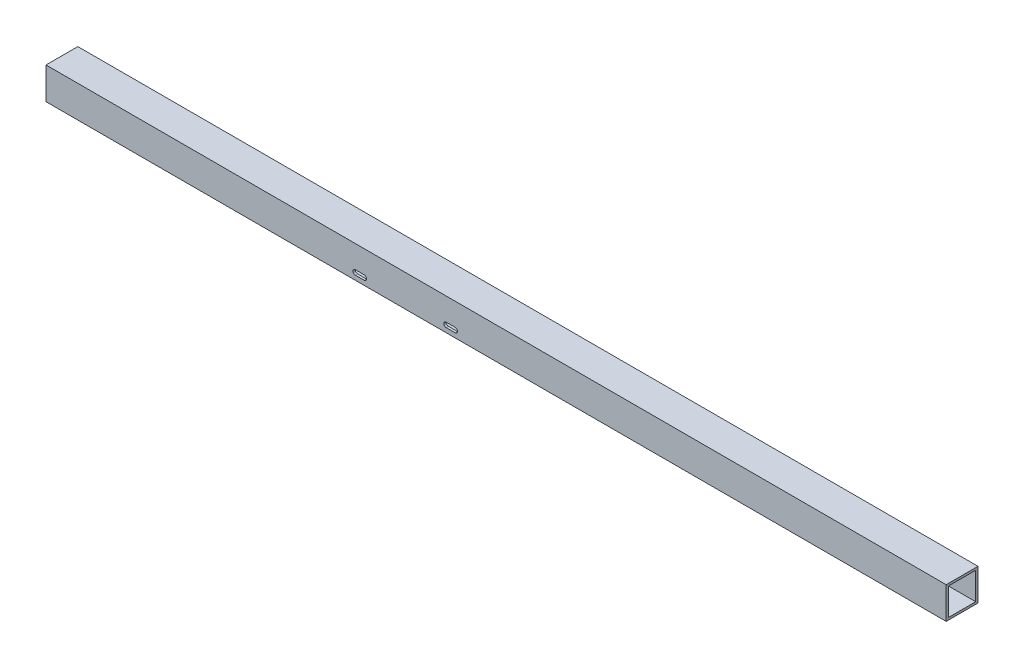
ISO-10303-21;
HEADER;
FILE_DESCRIPTION(('STEP AP214'),'2;1');
FILE_NAME('part.step','',(''),(''),'','','');
FILE_SCHEMA(('AUTOMOTIVE_DESIGN { 1 0 10303 214 1 1 1 1 }'));
ENDSEC;
DATA;
#1=APPLICATION_CONTEXT('core data for automotive mechanical design processes');
#2=APPLICATION_PROTOCOL_DEFINITION('international standard','automotive_design',2000,#1);
#3=PRODUCT_CONTEXT('',#1,'mechanical');
#4=PRODUCT('Part','Part','',(#3));
#5=PRODUCT_RELATED_PRODUCT_CATEGORY('part','',(#4));
#6=PRODUCT_DEFINITION_FORMATION('','',#4);
#7=PRODUCT_DEFINITION_CONTEXT('part definition',#1,'design');
#8=PRODUCT_DEFINITION('design','',#6,#7);
#9=PRODUCT_DEFINITION_SHAPE('','',#8);
#10=(LENGTH_UNIT() NAMED_UNIT(*) SI_UNIT(.MILLI.,.METRE.));
#11=(NAMED_UNIT(*) PLANE_ANGLE_UNIT() SI_UNIT($,.RADIAN.));
#12=(NAMED_UNIT(*) SI_UNIT($,.STERADIAN.) SOLID_ANGLE_UNIT());
#13=UNCERTAINTY_MEASURE_WITH_UNIT(LENGTH_MEASURE(1.E-05),#10,'distance_accuracy_value','');
#14=(GEOMETRIC_REPRESENTATION_CONTEXT(3) GLOBAL_UNCERTAINTY_ASSIGNED_CONTEXT((#13)) GLOBAL_UNIT_ASSIGNED_CONTEXT((#10,
#11,#12)) REPRESENTATION_CONTEXT('',''));
#15=CARTESIAN_POINT('',(0.,0.,0.));
#16=DIRECTION('',(0.,0.,1.));
#17=DIRECTION('',(1.,0.,0.));
#18=AXIS2_PLACEMENT_3D('',#15,#16,#17);
#19=CARTESIAN_POINT('',(628.65,0.,0.));
#20=DIRECTION('',(1.,0.,0.));
#21=DIRECTION('',(0.,0.,-1.));
#22=AXIS2_PLACEMENT_3D('',#19,#20,#21);
#23=PLANE('',#22);
#24=DIRECTION('',(0.,-1.,0.));
#25=VECTOR('',#24,1.);
#26=CARTESIAN_POINT('',(628.65,44.45,0.));
#27=LINE('',#26,#25);
#28=CARTESIAN_POINT('',(628.65,44.45,0.));
#29=VERTEX_POINT('',#28);
#30=CARTESIAN_POINT('',(628.65,0.,0.));
#31=VERTEX_POINT('',#30);
#32=EDGE_CURVE('E250',#29,#31,#27,.T.);
#33=ORIENTED_EDGE('',*,*,#32,.T.);
#34=DIRECTION('',(0.,0.,-1.));
#35=VECTOR('',#34,1.);
#36=CARTESIAN_POINT('',(628.65,0.,0.));
#37=LINE('',#36,#35);
#38=CARTESIAN_POINT('',(628.65,0.,-44.45));
#39=VERTEX_POINT('',#38);
#40=EDGE_CURVE('E253',#31,#39,#37,.T.);
#41=ORIENTED_EDGE('',*,*,#40,.T.);
#42=DIRECTION('',(0.,1.,0.));
#43=VECTOR('',#42,1.);
#44=CARTESIAN_POINT('',(628.65,0.,-44.45));
#45=LINE('',#44,#43);
#46=CARTESIAN_POINT('',(628.65,44.45,-44.45));
#47=VERTEX_POINT('',#46);
#48=EDGE_CURVE('E256',#39,#47,#45,.T.);
#49=ORIENTED_EDGE('',*,*,#48,.T.);
#50=DIRECTION('',(0.,0.,1.));
#51=VECTOR('',#50,1.);
#52=CARTESIAN_POINT('',(628.65,44.45,-44.45));
#53=LINE('',#52,#51);
#54=EDGE_CURVE('E258',#47,#29,#53,.T.);
#55=ORIENTED_EDGE('',*,*,#54,.T.);
#56=EDGE_LOOP('',(#33,#41,#49,#55));
#57=FACE_BOUND('',#56,.T.);
#58=DIRECTION('',(0.,0.,1.));
#59=VECTOR('',#58,1.);
#60=CARTESIAN_POINT('',(628.65,41.275,-41.275));
#61=LINE('',#60,#59);
#62=CARTESIAN_POINT('',(628.65,41.275,-41.275));
#63=VERTEX_POINT('',#62);
#64=CARTESIAN_POINT('',(628.65,41.275,-3.175));
#65=VERTEX_POINT('',#64);
#66=EDGE_CURVE('E221',#63,#65,#61,.T.);
#67=ORIENTED_EDGE('',*,*,#66,.F.);
#68=DIRECTION('',(0.,1.,0.));
#69=VECTOR('',#68,1.);
#70=CARTESIAN_POINT('',(628.65,3.175,-41.275));
#71=LINE('',#70,#69);
#72=CARTESIAN_POINT('',(628.65,3.175,-41.275));
#73=VERTEX_POINT('',#72);
#74=EDGE_CURVE('E219',#73,#63,#71,.T.);
#75=ORIENTED_EDGE('',*,*,#74,.F.);
#76=DIRECTION('',(0.,0.,-1.));
#77=VECTOR('',#76,1.);
#78=CARTESIAN_POINT('',(628.65,3.175,-3.17500000000001));
#79=LINE('',#78,#77);
#80=CARTESIAN_POINT('',(628.65,3.175,-3.17500000000001));
#81=VERTEX_POINT('',#80);
#82=EDGE_CURVE('E227',#81,#73,#79,.T.);
#83=ORIENTED_EDGE('',*,*,#82,.F.);
#84=DIRECTION('',(0.,-1.,0.));
#85=VECTOR('',#84,1.);
#86=CARTESIAN_POINT('',(628.65,41.275,-3.175));
#87=LINE('',#86,#85);
#88=EDGE_CURVE('E224',#65,#81,#87,.T.);
#89=ORIENTED_EDGE('',*,*,#88,.F.);
#90=EDGE_LOOP('',(#67,#75,#83,#89));
#91=FACE_BOUND('',#90,.T.);
#92=ADVANCED_FACE('F35',(#57,#91),#23,.T.);
#93=CARTESIAN_POINT('',(-628.65,0.,0.));
#94=DIRECTION('',(1.,0.,0.));
#95=DIRECTION('',(0.,0.,-1.));
#96=AXIS2_PLACEMENT_3D('',#93,#94,#95);
#97=PLANE('',#96);
#98=DIRECTION('',(0.,-1.,0.));
#99=VECTOR('',#98,1.);
#100=CARTESIAN_POINT('',(-628.65,44.45,0.));
#101=LINE('',#100,#99);
#102=CARTESIAN_POINT('',(-628.65,44.45,0.));
#103=VERTEX_POINT('',#102);
#104=CARTESIAN_POINT('',(-628.65,0.,0.));
#105=VERTEX_POINT('',#104);
#106=EDGE_CURVE('E249',#103,#105,#101,.T.);
#107=ORIENTED_EDGE('',*,*,#106,.F.);
#108=DIRECTION('',(0.,0.,1.));
#109=VECTOR('',#108,1.);
#110=CARTESIAN_POINT('',(-628.65,44.45,-44.45));
#111=LINE('',#110,#109);
#112=CARTESIAN_POINT('',(-628.65,44.45,-44.45));
#113=VERTEX_POINT('',#112);
#114=EDGE_CURVE('E254',#113,#103,#111,.T.);
#115=ORIENTED_EDGE('',*,*,#114,.F.);
#116=DIRECTION('',(0.,1.,0.));
#117=VECTOR('',#116,1.);
#118=CARTESIAN_POINT('',(-628.65,0.,-44.45));
#119=LINE('',#118,#117);
#120=CARTESIAN_POINT('',(-628.65,0.,-44.45));
#121=VERTEX_POINT('',#120);
#122=EDGE_CURVE('E265',#121,#113,#119,.T.);
#123=ORIENTED_EDGE('',*,*,#122,.F.);
#124=DIRECTION('',(0.,0.,-1.));
#125=VECTOR('',#124,1.);
#126=CARTESIAN_POINT('',(-628.65,0.,0.));
#127=LINE('',#126,#125);
#128=EDGE_CURVE('E263',#105,#121,#127,.T.);
#129=ORIENTED_EDGE('',*,*,#128,.F.);
#130=EDGE_LOOP('',(#107,#115,#123,#129));
#131=FACE_BOUND('',#130,.T.);
#132=DIRECTION('',(0.,1.,0.));
#133=VECTOR('',#132,1.);
#134=CARTESIAN_POINT('',(-628.65,3.175,-41.275));
#135=LINE('',#134,#133);
#136=CARTESIAN_POINT('',(-628.65,3.175,-41.275));
#137=VERTEX_POINT('',#136);
#138=CARTESIAN_POINT('',(-628.65,41.275,-41.275));
#139=VERTEX_POINT('',#138);
#140=EDGE_CURVE('E192',#137,#139,#135,.T.);
#141=ORIENTED_EDGE('',*,*,#140,.T.);
#142=DIRECTION('',(0.,0.,1.));
#143=VECTOR('',#142,1.);
#144=CARTESIAN_POINT('',(-628.65,41.275,-41.275));
#145=LINE('',#144,#143);
#146=CARTESIAN_POINT('',(-628.65,41.275,-3.175));
#147=VERTEX_POINT('',#146);
#148=EDGE_CURVE('E232',#139,#147,#145,.T.);
#149=ORIENTED_EDGE('',*,*,#148,.T.);
#150=DIRECTION('',(0.,-1.,0.));
#151=VECTOR('',#150,1.);
#152=CARTESIAN_POINT('',(-628.65,41.275,-3.175));
#153=LINE('',#152,#151);
#154=CARTESIAN_POINT('',(-628.65,3.175,-3.17500000000001));
#155=VERTEX_POINT('',#154);
#156=EDGE_CURVE('E235',#147,#155,#153,.T.);
#157=ORIENTED_EDGE('',*,*,#156,.T.);
#158=DIRECTION('',(0.,0.,-1.));
#159=VECTOR('',#158,1.);
#160=CARTESIAN_POINT('',(-628.65,3.175,-3.17500000000001));
#161=LINE('',#160,#159);
#162=EDGE_CURVE('E222',#155,#137,#161,.T.);
#163=ORIENTED_EDGE('',*,*,#162,.T.);
#164=EDGE_LOOP('',(#141,#149,#157,#163));
#165=FACE_BOUND('',#164,.T.);
#166=ADVANCED_FACE('F283',(#131,#165),#97,.F.);
#167=CARTESIAN_POINT('',(628.65,44.45,0.));
#168=DIRECTION('',(0.,0.,-1.));
#169=DIRECTION('',(0.,1.,0.));
#170=AXIS2_PLACEMENT_3D('',#167,#168,#169);
#171=PLANE('',#170);
#172=CARTESIAN_POINT('',(-184.277,9.525,0.));
#173=DIRECTION('',(0.,0.,1.));
#174=DIRECTION('',(1.,0.,0.));
#175=AXIS2_PLACEMENT_3D('',#172,#173,#174);
#176=CIRCLE('',#175,3.302);
#177=CARTESIAN_POINT('',(-184.277,6.223,0.));
#178=VERTEX_POINT('',#177);
#179=CARTESIAN_POINT('',(-184.277,12.827,0.));
#180=VERTEX_POINT('',#179);
#181=EDGE_CURVE('E164',#178,#180,#176,.T.);
#182=ORIENTED_EDGE('',*,*,#181,.F.);
#183=DIRECTION('',(1.,0.,0.));
#184=VECTOR('',#183,1.);
#185=CARTESIAN_POINT('',(-196.723,6.223,0.));
#186=LINE('',#185,#184);
#187=CARTESIAN_POINT('',(-196.723,6.223,0.));
#188=VERTEX_POINT('',#187);
#189=EDGE_CURVE('E182',#188,#178,#186,.T.);
#190=ORIENTED_EDGE('',*,*,#189,.F.);
#191=CARTESIAN_POINT('',(-196.723,9.525,0.));
#192=DIRECTION('',(0.,0.,1.));
#193=DIRECTION('',(1.,0.,0.));
#194=AXIS2_PLACEMENT_3D('',#191,#192,#193);
#195=CIRCLE('',#194,3.302);
#196=CARTESIAN_POINT('',(-196.723,12.827,0.));
#197=VERTEX_POINT('',#196);
#198=EDGE_CURVE('E179',#197,#188,#195,.T.);
#199=ORIENTED_EDGE('',*,*,#198,.F.);
#200=DIRECTION('',(-1.,0.,0.));
#201=VECTOR('',#200,1.);
#202=CARTESIAN_POINT('',(-196.723,12.827,0.));
#203=LINE('',#202,#201);
#204=EDGE_CURVE('E50',#180,#197,#203,.T.);
#205=ORIENTED_EDGE('',*,*,#204,.F.);
#206=EDGE_LOOP('',(#182,#190,#199,#205));
#207=FACE_BOUND('',#206,.T.);
#208=CARTESIAN_POINT('',(-57.277,9.525,0.));
#209=DIRECTION('',(0.,0.,1.));
#210=DIRECTION('',(1.,0.,0.));
#211=AXIS2_PLACEMENT_3D('',#208,#209,#210);
#212=CIRCLE('',#211,3.302);
#213=CARTESIAN_POINT('',(-57.277,6.223,0.));
#214=VERTEX_POINT('',#213);
#215=CARTESIAN_POINT('',(-57.277,12.827,0.));
#216=VERTEX_POINT('',#215);
#217=EDGE_CURVE('E208',#214,#216,#212,.T.);
#218=ORIENTED_EDGE('',*,*,#217,.F.);
#219=DIRECTION('',(1.,0.,0.));
#220=VECTOR('',#219,1.);
#221=CARTESIAN_POINT('',(-69.723,6.223,0.));
#222=LINE('',#221,#220);
#223=CARTESIAN_POINT('',(-69.723,6.223,0.));
#224=VERTEX_POINT('',#223);
#225=EDGE_CURVE('E205',#224,#214,#222,.T.);
#226=ORIENTED_EDGE('',*,*,#225,.F.);
#227=CARTESIAN_POINT('',(-69.723,9.525,0.));
#228=DIRECTION('',(0.,0.,1.));
#229=DIRECTION('',(1.,0.,0.));
#230=AXIS2_PLACEMENT_3D('',#227,#228,#229);
#231=CIRCLE('',#230,3.302);
#232=CARTESIAN_POINT('',(-69.723,12.827,0.));
#233=VERTEX_POINT('',#232);
#234=EDGE_CURVE('E202',#233,#224,#231,.T.);
#235=ORIENTED_EDGE('',*,*,#234,.F.);
#236=DIRECTION('',(-1.,0.,0.));
#237=VECTOR('',#236,1.);
#238=CARTESIAN_POINT('',(-69.723,12.827,0.));
#239=LINE('',#238,#237);
#240=EDGE_CURVE('E58',#216,#233,#239,.T.);
#241=ORIENTED_EDGE('',*,*,#240,.F.);
#242=EDGE_LOOP('',(#218,#226,#235,#241));
#243=FACE_BOUND('',#242,.T.);
#244=ORIENTED_EDGE('',*,*,#106,.T.);
#245=DIRECTION('',(-1.,0.,0.));
#246=VECTOR('',#245,1.);
#247=CARTESIAN_POINT('',(628.65,0.,0.));
#248=LINE('',#247,#246);
#249=EDGE_CURVE('E11',#31,#105,#248,.T.);
#250=ORIENTED_EDGE('',*,*,#249,.F.);
#251=ORIENTED_EDGE('',*,*,#32,.F.);
#252=DIRECTION('',(-1.,0.,0.));
#253=VECTOR('',#252,1.);
#254=CARTESIAN_POINT('',(628.65,44.45,0.));
#255=LINE('',#254,#253);
#256=EDGE_CURVE('E260',#29,#103,#255,.T.);
#257=ORIENTED_EDGE('',*,*,#256,.T.);
#258=EDGE_LOOP('',(#244,#250,#251,#257));
#259=FACE_BOUND('',#258,.T.);
#260=ADVANCED_FACE('F37',(#207,#243,#259),#171,.F.);
#261=CARTESIAN_POINT('',(628.65,0.,0.));
#262=DIRECTION('',(0.,1.,0.));
#263=DIRECTION('',(0.,0.,1.));
#264=AXIS2_PLACEMENT_3D('',#261,#262,#263);
#265=PLANE('',#264);
#266=ORIENTED_EDGE('',*,*,#128,.T.);
#267=DIRECTION('',(-1.,0.,0.));
#268=VECTOR('',#267,1.);
#269=CARTESIAN_POINT('',(628.65,0.,-44.45));
#270=LINE('',#269,#268);
#271=EDGE_CURVE('E43',#39,#121,#270,.T.);
#272=ORIENTED_EDGE('',*,*,#271,.F.);
#273=ORIENTED_EDGE('',*,*,#40,.F.);
#274=ORIENTED_EDGE('',*,*,#249,.T.);
#275=EDGE_LOOP('',(#266,#272,#273,#274));
#276=FACE_BOUND('',#275,.T.);
#277=ADVANCED_FACE('F294',(#276),#265,.F.);
#278=CARTESIAN_POINT('',(628.65,0.,-44.45));
#279=DIRECTION('',(0.,0.,1.));
#280=DIRECTION('',(0.,-1.,0.));
#281=AXIS2_PLACEMENT_3D('',#278,#279,#280);
#282=PLANE('',#281);
#283=ORIENTED_EDGE('',*,*,#122,.T.);
#284=DIRECTION('',(-1.,0.,0.));
#285=VECTOR('',#284,1.);
#286=CARTESIAN_POINT('',(628.65,44.45,-44.45));
#287=LINE('',#286,#285);
#288=EDGE_CURVE('E270',#47,#113,#287,.T.);
#289=ORIENTED_EDGE('',*,*,#288,.F.);
#290=ORIENTED_EDGE('',*,*,#48,.F.);
#291=ORIENTED_EDGE('',*,*,#271,.T.);
#292=EDGE_LOOP('',(#283,#289,#290,#291));
#293=FACE_BOUND('',#292,.T.);
#294=ADVANCED_FACE('F277',(#293),#282,.F.);
#295=CARTESIAN_POINT('',(628.65,44.45,-44.45));
#296=DIRECTION('',(0.,-1.,0.));
#297=DIRECTION('',(0.,0.,-1.));
#298=AXIS2_PLACEMENT_3D('',#295,#296,#297);
#299=PLANE('',#298);
#300=ORIENTED_EDGE('',*,*,#114,.T.);
#301=ORIENTED_EDGE('',*,*,#256,.F.);
#302=ORIENTED_EDGE('',*,*,#54,.F.);
#303=ORIENTED_EDGE('',*,*,#288,.T.);
#304=EDGE_LOOP('',(#300,#301,#302,#303));
#305=FACE_BOUND('',#304,.T.);
#306=ADVANCED_FACE('F287',(#305),#299,.F.);
#307=CARTESIAN_POINT('',(628.65,3.175,-41.275));
#308=DIRECTION('',(0.,0.,1.));
#309=DIRECTION('',(0.,-1.,0.));
#310=AXIS2_PLACEMENT_3D('',#307,#308,#309);
#311=PLANE('',#310);
#312=ORIENTED_EDGE('',*,*,#140,.F.);
#313=DIRECTION('',(-1.,0.,0.));
#314=VECTOR('',#313,1.);
#315=CARTESIAN_POINT('',(628.65,3.175,-41.275));
#316=LINE('',#315,#314);
#317=EDGE_CURVE('E229',#73,#137,#316,.T.);
#318=ORIENTED_EDGE('',*,*,#317,.F.);
#319=ORIENTED_EDGE('',*,*,#74,.T.);
#320=DIRECTION('',(-1.,0.,0.));
#321=VECTOR('',#320,1.);
#322=CARTESIAN_POINT('',(628.65,41.275,-41.275));
#323=LINE('',#322,#321);
#324=EDGE_CURVE('E246',#63,#139,#323,.T.);
#325=ORIENTED_EDGE('',*,*,#324,.T.);
#326=EDGE_LOOP('',(#312,#318,#319,#325));
#327=FACE_BOUND('',#326,.T.);
#328=ADVANCED_FACE('F310',(#327),#311,.T.);
#329=CARTESIAN_POINT('',(628.65,41.275,-41.275));
#330=DIRECTION('',(0.,-1.,0.));
#331=DIRECTION('',(0.,0.,-1.));
#332=AXIS2_PLACEMENT_3D('',#329,#330,#331);
#333=PLANE('',#332);
#334=ORIENTED_EDGE('',*,*,#148,.F.);
#335=ORIENTED_EDGE('',*,*,#324,.F.);
#336=ORIENTED_EDGE('',*,*,#66,.T.);
#337=DIRECTION('',(-1.,0.,0.));
#338=VECTOR('',#337,1.);
#339=CARTESIAN_POINT('',(628.65,41.275,-3.175));
#340=LINE('',#339,#338);
#341=EDGE_CURVE('E244',#65,#147,#340,.T.);
#342=ORIENTED_EDGE('',*,*,#341,.T.);
#343=EDGE_LOOP('',(#334,#335,#336,#342));
#344=FACE_BOUND('',#343,.T.);
#345=ADVANCED_FACE('F317',(#344),#333,.T.);
#346=CARTESIAN_POINT('',(628.65,41.275,-3.175));
#347=DIRECTION('',(0.,0.,-1.));
#348=DIRECTION('',(0.,1.,0.));
#349=AXIS2_PLACEMENT_3D('',#346,#347,#348);
#350=PLANE('',#349);
#351=DIRECTION('',(1.,0.,0.));
#352=VECTOR('',#351,1.);
#353=CARTESIAN_POINT('',(-196.723,6.223,-3.175));
#354=LINE('',#353,#352);
#355=CARTESIAN_POINT('',(-196.723,6.223,-3.175));
#356=VERTEX_POINT('',#355);
#357=CARTESIAN_POINT('',(-184.277,6.223,-3.175));
#358=VERTEX_POINT('',#357);
#359=EDGE_CURVE('E171',#356,#358,#354,.T.);
#360=ORIENTED_EDGE('',*,*,#359,.T.);
#361=CARTESIAN_POINT('',(-184.277,9.525,-3.175));
#362=DIRECTION('',(0.,0.,-1.));
#363=DIRECTION('',(0.,1.,0.));
#364=AXIS2_PLACEMENT_3D('',#361,#362,#363);
#365=CIRCLE('',#364,3.302);
#366=CARTESIAN_POINT('',(-184.277,12.827,-3.175));
#367=VERTEX_POINT('',#366);
#368=EDGE_CURVE('E158',#358,#367,#365,.F.);
#369=ORIENTED_EDGE('',*,*,#368,.T.);
#370=DIRECTION('',(-1.,0.,0.));
#371=VECTOR('',#370,1.);
#372=CARTESIAN_POINT('',(-196.723,12.827,-3.175));
#373=LINE('',#372,#371);
#374=CARTESIAN_POINT('',(-196.723,12.827,-3.175));
#375=VERTEX_POINT('',#374);
#376=EDGE_CURVE('E148',#367,#375,#373,.T.);
#377=ORIENTED_EDGE('',*,*,#376,.T.);
#378=CARTESIAN_POINT('',(-196.723,9.525,-3.175));
#379=DIRECTION('',(0.,0.,-1.));
#380=DIRECTION('',(0.,1.,0.));
#381=AXIS2_PLACEMENT_3D('',#378,#379,#380);
#382=CIRCLE('',#381,3.302);
#383=EDGE_CURVE('E157',#375,#356,#382,.F.);
#384=ORIENTED_EDGE('',*,*,#383,.T.);
#385=EDGE_LOOP('',(#360,#369,#377,#384));
#386=FACE_BOUND('',#385,.T.);
#387=DIRECTION('',(1.,0.,0.));
#388=VECTOR('',#387,1.);
#389=CARTESIAN_POINT('',(-69.723,6.223,-3.175));
#390=LINE('',#389,#388);
#391=CARTESIAN_POINT('',(-69.723,6.223,-3.175));
#392=VERTEX_POINT('',#391);
#393=CARTESIAN_POINT('',(-57.277,6.223,-3.175));
#394=VERTEX_POINT('',#393);
#395=EDGE_CURVE('E172',#392,#394,#390,.T.);
#396=ORIENTED_EDGE('',*,*,#395,.T.);
#397=CARTESIAN_POINT('',(-57.277,9.525,-3.175));
#398=DIRECTION('',(0.,0.,-1.));
#399=DIRECTION('',(0.,1.,0.));
#400=AXIS2_PLACEMENT_3D('',#397,#398,#399);
#401=CIRCLE('',#400,3.302);
#402=CARTESIAN_POINT('',(-57.277,12.827,-3.175));
#403=VERTEX_POINT('',#402);
#404=EDGE_CURVE('E193',#394,#403,#401,.F.);
#405=ORIENTED_EDGE('',*,*,#404,.T.);
#406=DIRECTION('',(-1.,0.,0.));
#407=VECTOR('',#406,1.);
#408=CARTESIAN_POINT('',(-69.723,12.827,-3.175));
#409=LINE('',#408,#407);
#410=CARTESIAN_POINT('',(-69.723,12.827,-3.175));
#411=VERTEX_POINT('',#410);
#412=EDGE_CURVE('E196',#403,#411,#409,.T.);
#413=ORIENTED_EDGE('',*,*,#412,.T.);
#414=CARTESIAN_POINT('',(-69.723,9.525,-3.175));
#415=DIRECTION('',(0.,0.,-1.));
#416=DIRECTION('',(0.,1.,0.));
#417=AXIS2_PLACEMENT_3D('',#414,#415,#416);
#418=CIRCLE('',#417,3.302);
#419=EDGE_CURVE('E199',#411,#392,#418,.F.);
#420=ORIENTED_EDGE('',*,*,#419,.T.);
#421=EDGE_LOOP('',(#396,#405,#413,#420));
#422=FACE_BOUND('',#421,.T.);
#423=ORIENTED_EDGE('',*,*,#156,.F.);
#424=ORIENTED_EDGE('',*,*,#341,.F.);
#425=ORIENTED_EDGE('',*,*,#88,.T.);
#426=DIRECTION('',(-1.,0.,0.));
#427=VECTOR('',#426,1.);
#428=CARTESIAN_POINT('',(628.65,3.175,-3.17500000000001));
#429=LINE('',#428,#427);
#430=EDGE_CURVE('E242',#81,#155,#429,.T.);
#431=ORIENTED_EDGE('',*,*,#430,.T.);
#432=EDGE_LOOP('',(#423,#424,#425,#431));
#433=FACE_BOUND('',#432,.T.);
#434=ADVANCED_FACE('F168',(#386,#422,#433),#350,.T.);
#435=CARTESIAN_POINT('',(628.65,3.175,-3.17500000000001));
#436=DIRECTION('',(0.,1.,0.));
#437=DIRECTION('',(0.,0.,1.));
#438=AXIS2_PLACEMENT_3D('',#435,#436,#437);
#439=PLANE('',#438);
#440=ORIENTED_EDGE('',*,*,#162,.F.);
#441=ORIENTED_EDGE('',*,*,#430,.F.);
#442=ORIENTED_EDGE('',*,*,#82,.T.);
#443=ORIENTED_EDGE('',*,*,#317,.T.);
#444=EDGE_LOOP('',(#440,#441,#442,#443));
#445=FACE_BOUND('',#444,.T.);
#446=ADVANCED_FACE('F328',(#445),#439,.T.);
#447=CARTESIAN_POINT('',(-69.723,6.223,-44.451));
#448=DIRECTION('',(0.,-1.,0.));
#449=DIRECTION('',(1.,0.,0.));
#450=AXIS2_PLACEMENT_3D('',#447,#448,#449);
#451=PLANE('',#450);
#452=DIRECTION('',(0.,0.,1.));
#453=VECTOR('',#452,1.);
#454=CARTESIAN_POINT('',(-69.723,6.223,-44.451));
#455=LINE('',#454,#453);
#456=EDGE_CURVE('E212',#392,#224,#455,.T.);
#457=ORIENTED_EDGE('',*,*,#456,.T.);
#458=ORIENTED_EDGE('',*,*,#225,.T.);
#459=DIRECTION('',(0.,0.,1.));
#460=VECTOR('',#459,1.);
#461=CARTESIAN_POINT('',(-57.277,6.223,-44.451));
#462=LINE('',#461,#460);
#463=EDGE_CURVE('E216',#394,#214,#462,.T.);
#464=ORIENTED_EDGE('',*,*,#463,.F.);
#465=ORIENTED_EDGE('',*,*,#395,.F.);
#466=EDGE_LOOP('',(#457,#458,#464,#465));
#467=FACE_BOUND('',#466,.T.);
#468=ADVANCED_FACE('F341',(#467),#451,.F.);
#469=CARTESIAN_POINT('',(-57.277,9.525,-44.451));
#470=DIRECTION('',(0.,0.,1.));
#471=DIRECTION('',(1.,0.,0.));
#472=AXIS2_PLACEMENT_3D('',#469,#470,#471);
#473=CYLINDRICAL_SURFACE('',#472,3.302);
#474=ORIENTED_EDGE('',*,*,#463,.T.);
#475=ORIENTED_EDGE('',*,*,#217,.T.);
#476=DIRECTION('',(0.,0.,1.));
#477=VECTOR('',#476,1.);
#478=CARTESIAN_POINT('',(-57.277,12.827,-44.451));
#479=LINE('',#478,#477);
#480=EDGE_CURVE('E214',#403,#216,#479,.T.);
#481=ORIENTED_EDGE('',*,*,#480,.F.);
#482=ORIENTED_EDGE('',*,*,#404,.F.);
#483=EDGE_LOOP('',(#474,#475,#481,#482));
#484=FACE_BOUND('',#483,.T.);
#485=ADVANCED_FACE('F352',(#484),#473,.F.);
#486=CARTESIAN_POINT('',(-69.723,12.827,-44.451));
#487=DIRECTION('',(0.,1.,0.));
#488=DIRECTION('',(-1.,0.,0.));
#489=AXIS2_PLACEMENT_3D('',#486,#487,#488);
#490=PLANE('',#489);
#491=ORIENTED_EDGE('',*,*,#480,.T.);
#492=ORIENTED_EDGE('',*,*,#240,.T.);
#493=DIRECTION('',(0.,0.,1.));
#494=VECTOR('',#493,1.);
#495=CARTESIAN_POINT('',(-69.723,12.827,-44.451));
#496=LINE('',#495,#494);
#497=EDGE_CURVE('E175',#411,#233,#496,.T.);
#498=ORIENTED_EDGE('',*,*,#497,.F.);
#499=ORIENTED_EDGE('',*,*,#412,.F.);
#500=EDGE_LOOP('',(#491,#492,#498,#499));
#501=FACE_BOUND('',#500,.T.);
#502=ADVANCED_FACE('F348',(#501),#490,.F.);
#503=CARTESIAN_POINT('',(-69.723,9.525,-44.451));
#504=DIRECTION('',(0.,0.,1.));
#505=DIRECTION('',(1.,0.,0.));
#506=AXIS2_PLACEMENT_3D('',#503,#504,#505);
#507=CYLINDRICAL_SURFACE('',#506,3.302);
#508=ORIENTED_EDGE('',*,*,#497,.T.);
#509=ORIENTED_EDGE('',*,*,#234,.T.);
#510=ORIENTED_EDGE('',*,*,#456,.F.);
#511=ORIENTED_EDGE('',*,*,#419,.F.);
#512=EDGE_LOOP('',(#508,#509,#510,#511));
#513=FACE_BOUND('',#512,.T.);
#514=ADVANCED_FACE('F344',(#513),#507,.F.);
#515=CARTESIAN_POINT('',(-196.723,6.223,-44.451));
#516=DIRECTION('',(0.,-1.,0.));
#517=DIRECTION('',(1.,0.,0.));
#518=AXIS2_PLACEMENT_3D('',#515,#516,#517);
#519=PLANE('',#518);
#520=DIRECTION('',(0.,0.,1.));
#521=VECTOR('',#520,1.);
#522=CARTESIAN_POINT('',(-196.723,6.223,-44.451));
#523=LINE('',#522,#521);
#524=EDGE_CURVE('E187',#356,#188,#523,.T.);
#525=ORIENTED_EDGE('',*,*,#524,.T.);
#526=ORIENTED_EDGE('',*,*,#189,.T.);
#527=DIRECTION('',(0.,0.,1.));
#528=VECTOR('',#527,1.);
#529=CARTESIAN_POINT('',(-184.277,6.223,-44.451));
#530=LINE('',#529,#528);
#531=EDGE_CURVE('E165',#358,#178,#530,.T.);
#532=ORIENTED_EDGE('',*,*,#531,.F.);
#533=ORIENTED_EDGE('',*,*,#359,.F.);
#534=EDGE_LOOP('',(#525,#526,#532,#533));
#535=FACE_BOUND('',#534,.T.);
#536=ADVANCED_FACE('F347',(#535),#519,.F.);
#537=CARTESIAN_POINT('',(-184.277,9.525,-44.451));
#538=DIRECTION('',(0.,0.,1.));
#539=DIRECTION('',(1.,0.,0.));
#540=AXIS2_PLACEMENT_3D('',#537,#538,#539);
#541=CYLINDRICAL_SURFACE('',#540,3.302);
#542=ORIENTED_EDGE('',*,*,#531,.T.);
#543=ORIENTED_EDGE('',*,*,#181,.T.);
#544=DIRECTION('',(0.,0.,1.));
#545=VECTOR('',#544,1.);
#546=CARTESIAN_POINT('',(-184.277,12.827,-44.451));
#547=LINE('',#546,#545);
#548=EDGE_CURVE('E151',#367,#180,#547,.T.);
#549=ORIENTED_EDGE('',*,*,#548,.F.);
#550=ORIENTED_EDGE('',*,*,#368,.F.);
#551=EDGE_LOOP('',(#542,#543,#549,#550));
#552=FACE_BOUND('',#551,.T.);
#553=ADVANCED_FACE('F161',(#552),#541,.F.);
#554=CARTESIAN_POINT('',(-196.723,12.827,-44.451));
#555=DIRECTION('',(0.,1.,0.));
#556=DIRECTION('',(-1.,0.,0.));
#557=AXIS2_PLACEMENT_3D('',#554,#555,#556);
#558=PLANE('',#557);
#559=ORIENTED_EDGE('',*,*,#548,.T.);
#560=ORIENTED_EDGE('',*,*,#204,.T.);
#561=DIRECTION('',(0.,0.,1.));
#562=VECTOR('',#561,1.);
#563=CARTESIAN_POINT('',(-196.723,12.827,-44.451));
#564=LINE('',#563,#562);
#565=EDGE_CURVE('E153',#375,#197,#564,.T.);
#566=ORIENTED_EDGE('',*,*,#565,.F.);
#567=ORIENTED_EDGE('',*,*,#376,.F.);
#568=EDGE_LOOP('',(#559,#560,#566,#567));
#569=FACE_BOUND('',#568,.T.);
#570=ADVANCED_FACE('F150',(#569),#558,.F.);
#571=CARTESIAN_POINT('',(-196.723,9.525,-44.451));
#572=DIRECTION('',(0.,0.,1.));
#573=DIRECTION('',(1.,0.,0.));
#574=AXIS2_PLACEMENT_3D('',#571,#572,#573);
#575=CYLINDRICAL_SURFACE('',#574,3.302);
#576=ORIENTED_EDGE('',*,*,#565,.T.);
#577=ORIENTED_EDGE('',*,*,#198,.T.);
#578=ORIENTED_EDGE('',*,*,#524,.F.);
#579=ORIENTED_EDGE('',*,*,#383,.F.);
#580=EDGE_LOOP('',(#576,#577,#578,#579));
#581=FACE_BOUND('',#580,.T.);
#582=ADVANCED_FACE('F359',(#581),#575,.F.);
#583=CLOSED_SHELL('',(#92,#166,#260,#277,#294,#306,#328,#345,#434,#446,#468,#485,#502,#514,#536,
#553,#570,#582));
#584=MANIFOLD_SOLID_BREP('B2',#583);
#585=ADVANCED_BREP_SHAPE_REPRESENTATION('',(#18,#584),#14);
#586=SHAPE_DEFINITION_REPRESENTATION(#9,#585);
ENDSEC;
END-ISO-10303-21;
